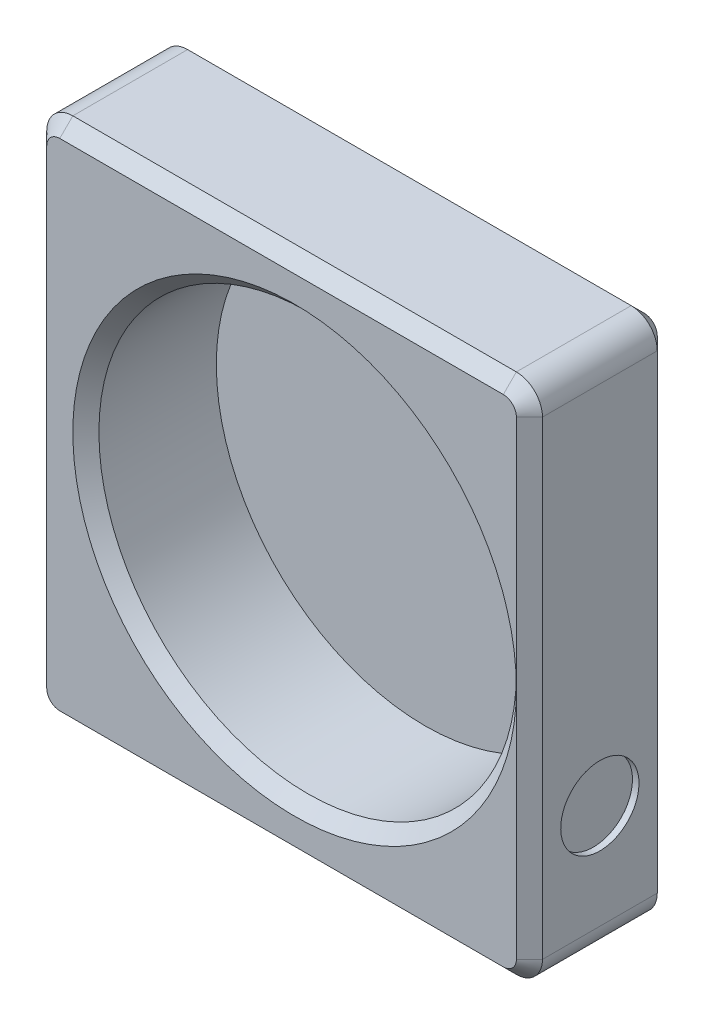
ISO-10303-21;
HEADER;
FILE_DESCRIPTION(('STEP AP214'),'2;1');
FILE_NAME('part.step','',(''),(''),'','','');
FILE_SCHEMA(('AUTOMOTIVE_DESIGN { 1 0 10303 214 1 1 1 1 }'));
ENDSEC;
DATA;
#1=APPLICATION_CONTEXT('core data for automotive mechanical design processes');
#2=APPLICATION_PROTOCOL_DEFINITION('international standard','automotive_design',2000,#1);
#3=PRODUCT_CONTEXT('',#1,'mechanical');
#4=PRODUCT('Part','Part','',(#3));
#5=PRODUCT_RELATED_PRODUCT_CATEGORY('part','',(#4));
#6=PRODUCT_DEFINITION_FORMATION('','',#4);
#7=PRODUCT_DEFINITION_CONTEXT('part definition',#1,'design');
#8=PRODUCT_DEFINITION('design','',#6,#7);
#9=PRODUCT_DEFINITION_SHAPE('','',#8);
#10=(LENGTH_UNIT() NAMED_UNIT(*) SI_UNIT(.MILLI.,.METRE.));
#11=(NAMED_UNIT(*) PLANE_ANGLE_UNIT() SI_UNIT($,.RADIAN.));
#12=(NAMED_UNIT(*) SI_UNIT($,.STERADIAN.) SOLID_ANGLE_UNIT());
#13=UNCERTAINTY_MEASURE_WITH_UNIT(LENGTH_MEASURE(1.E-05),#10,'distance_accuracy_value','');
#14=(GEOMETRIC_REPRESENTATION_CONTEXT(3) GLOBAL_UNCERTAINTY_ASSIGNED_CONTEXT((#13)) GLOBAL_UNIT_ASSIGNED_CONTEXT((#10,
#11,#12)) REPRESENTATION_CONTEXT('',''));
#15=CARTESIAN_POINT('',(0.,0.,0.));
#16=DIRECTION('',(0.,0.,1.));
#17=DIRECTION('',(1.,0.,0.));
#18=AXIS2_PLACEMENT_3D('',#15,#16,#17);
#19=CARTESIAN_POINT('',(-10.,-10.,5.4));
#20=DIRECTION('',(1.,0.,0.));
#21=DIRECTION('',(0.,0.,-1.));
#22=AXIS2_PLACEMENT_3D('',#19,#20,#21);
#23=PLANE('',#22);
#24=DIRECTION('',(0.,0.,1.));
#25=VECTOR('',#24,1.);
#26=CARTESIAN_POINT('',(-10.,4.5,0.));
#27=LINE('',#26,#25);
#28=CARTESIAN_POINT('',(-10.,4.5,0.500000000000004));
#29=VERTEX_POINT('',#28);
#30=CARTESIAN_POINT('',(-10.,4.5,4.9));
#31=VERTEX_POINT('',#30);
#32=EDGE_CURVE('E219',#29,#31,#27,.T.);
#33=ORIENTED_EDGE('',*,*,#32,.F.);
#34=DIRECTION('',(0.,-1.,0.));
#35=VECTOR('',#34,1.);
#36=CARTESIAN_POINT('',(-10.,-9.,0.500000000000004));
#37=LINE('',#36,#35);
#38=CARTESIAN_POINT('',(-10.,-9.,0.500000000000004));
#39=VERTEX_POINT('',#38);
#40=EDGE_CURVE('E193',#29,#39,#37,.T.);
#41=ORIENTED_EDGE('',*,*,#40,.T.);
#42=DIRECTION('',(0.,0.,-1.));
#43=VECTOR('',#42,1.);
#44=CARTESIAN_POINT('',(-10.,-9.,5.4));
#45=LINE('',#44,#43);
#46=CARTESIAN_POINT('',(-10.,-9.,4.9));
#47=VERTEX_POINT('',#46);
#48=EDGE_CURVE('E216',#39,#47,#45,.F.);
#49=ORIENTED_EDGE('',*,*,#48,.T.);
#50=DIRECTION('',(0.,1.,0.));
#51=VECTOR('',#50,1.);
#52=CARTESIAN_POINT('',(-10.,-10.,4.9));
#53=LINE('',#52,#51);
#54=EDGE_CURVE('E220',#47,#31,#53,.T.);
#55=ORIENTED_EDGE('',*,*,#54,.T.);
#56=EDGE_LOOP('',(#33,#41,#49,#55));
#57=FACE_BOUND('',#56,.T.);
#58=ADVANCED_FACE('F45',(#57),#23,.F.);
#59=CARTESIAN_POINT('',(-10.,10.,5.4));
#60=DIRECTION('',(0.,-1.,0.));
#61=DIRECTION('',(0.,0.,-1.));
#62=AXIS2_PLACEMENT_3D('',#59,#60,#61);
#63=PLANE('',#62);
#64=DIRECTION('',(0.,0.,1.));
#65=VECTOR('',#64,1.);
#66=CARTESIAN_POINT('',(8.,10.,5.4));
#67=LINE('',#66,#65);
#68=CARTESIAN_POINT('',(8.,10.,4.9));
#69=VERTEX_POINT('',#68);
#70=CARTESIAN_POINT('',(8.,10.,0.500000000000004));
#71=VERTEX_POINT('',#70);
#72=EDGE_CURVE('E225',#69,#71,#67,.F.);
#73=ORIENTED_EDGE('',*,*,#72,.T.);
#74=DIRECTION('',(-1.,0.,0.));
#75=VECTOR('',#74,1.);
#76=CARTESIAN_POINT('',(-9.,10.,0.500000000000004));
#77=LINE('',#76,#75);
#78=CARTESIAN_POINT('',(-9.,10.,0.500000000000004));
#79=VERTEX_POINT('',#78);
#80=EDGE_CURVE('E279',#71,#79,#77,.T.);
#81=ORIENTED_EDGE('',*,*,#80,.T.);
#82=DIRECTION('',(0.,0.,-1.));
#83=VECTOR('',#82,1.);
#84=CARTESIAN_POINT('',(-9.,10.,5.4));
#85=LINE('',#84,#83);
#86=CARTESIAN_POINT('',(-9.,10.,4.9));
#87=VERTEX_POINT('',#86);
#88=EDGE_CURVE('E230',#79,#87,#85,.F.);
#89=ORIENTED_EDGE('',*,*,#88,.T.);
#90=DIRECTION('',(1.,0.,0.));
#91=VECTOR('',#90,1.);
#92=CARTESIAN_POINT('',(-10.,10.,4.9));
#93=LINE('',#92,#91);
#94=EDGE_CURVE('E277',#87,#69,#93,.T.);
#95=ORIENTED_EDGE('',*,*,#94,.T.);
#96=EDGE_LOOP('',(#73,#81,#89,#95));
#97=FACE_BOUND('',#96,.T.);
#98=ADVANCED_FACE('F407',(#97),#63,.F.);
#99=DIRECTION('',(0.,0.,-1.));
#100=VECTOR('',#99,1.);
#101=CARTESIAN_POINT('',(-10.,9.,5.4));
#102=LINE('',#101,#100);
#103=CARTESIAN_POINT('',(-10.,9.,4.9));
#104=VERTEX_POINT('',#103);
#105=CARTESIAN_POINT('',(-10.,9.,0.500000000000004));
#106=VERTEX_POINT('',#105);
#107=EDGE_CURVE('E224',#104,#106,#102,.T.);
#108=ORIENTED_EDGE('',*,*,#107,.T.);
#109=DIRECTION('',(0.,-1.,0.));
#110=VECTOR('',#109,1.);
#111=CARTESIAN_POINT('',(-10.,5.5,0.500000000000004));
#112=LINE('',#111,#110);
#113=CARTESIAN_POINT('',(-10.,5.5,0.500000000000004));
#114=VERTEX_POINT('',#113);
#115=EDGE_CURVE('E288',#106,#114,#112,.T.);
#116=ORIENTED_EDGE('',*,*,#115,.T.);
#117=DIRECTION('',(0.,0.,-1.));
#118=VECTOR('',#117,1.);
#119=CARTESIAN_POINT('',(-10.,5.5,0.));
#120=LINE('',#119,#118);
#121=CARTESIAN_POINT('',(-10.,5.5,4.9));
#122=VERTEX_POINT('',#121);
#123=EDGE_CURVE('E506',#122,#114,#120,.T.);
#124=ORIENTED_EDGE('',*,*,#123,.F.);
#125=DIRECTION('',(0.,1.,0.));
#126=VECTOR('',#125,1.);
#127=CARTESIAN_POINT('',(-10.,-10.,4.9));
#128=LINE('',#127,#126);
#129=EDGE_CURVE('E286',#122,#104,#128,.T.);
#130=ORIENTED_EDGE('',*,*,#129,.T.);
#131=EDGE_LOOP('',(#108,#116,#124,#130));
#132=FACE_BOUND('',#131,.T.);
#133=ADVANCED_FACE('F476',(#132),#23,.F.);
#134=CARTESIAN_POINT('',(-10.,-10.,5.4));
#135=DIRECTION('',(0.,1.,0.));
#136=DIRECTION('',(0.,0.,1.));
#137=AXIS2_PLACEMENT_3D('',#134,#135,#136);
#138=PLANE('',#137);
#139=DIRECTION('',(0.,0.,-1.));
#140=VECTOR('',#139,1.);
#141=CARTESIAN_POINT('',(-9.,-10.,5.4));
#142=LINE('',#141,#140);
#143=CARTESIAN_POINT('',(-9.,-10.,4.9));
#144=VERTEX_POINT('',#143);
#145=CARTESIAN_POINT('',(-9.,-10.,0.500000000000004));
#146=VERTEX_POINT('',#145);
#147=EDGE_CURVE('E385',#144,#146,#142,.T.);
#148=ORIENTED_EDGE('',*,*,#147,.T.);
#149=DIRECTION('',(1.,0.,0.));
#150=VECTOR('',#149,1.);
#151=CARTESIAN_POINT('',(8.00000000000001,-10.,0.500000000000004));
#152=LINE('',#151,#150);
#153=CARTESIAN_POINT('',(8.00000000000001,-10.,0.500000000000004));
#154=VERTEX_POINT('',#153);
#155=EDGE_CURVE('E263',#146,#154,#152,.T.);
#156=ORIENTED_EDGE('',*,*,#155,.T.);
#157=DIRECTION('',(0.,0.,1.));
#158=VECTOR('',#157,1.);
#159=CARTESIAN_POINT('',(8.00000000000001,-10.,5.4));
#160=LINE('',#159,#158);
#161=CARTESIAN_POINT('',(8.00000000000001,-10.,4.9));
#162=VERTEX_POINT('',#161);
#163=EDGE_CURVE('E390',#154,#162,#160,.T.);
#164=ORIENTED_EDGE('',*,*,#163,.T.);
#165=DIRECTION('',(-1.,0.,0.));
#166=VECTOR('',#165,1.);
#167=CARTESIAN_POINT('',(-10.,-10.,4.9));
#168=LINE('',#167,#166);
#169=EDGE_CURVE('E209',#162,#144,#168,.T.);
#170=ORIENTED_EDGE('',*,*,#169,.T.);
#171=EDGE_LOOP('',(#148,#156,#164,#170));
#172=FACE_BOUND('',#171,.T.);
#173=ADVANCED_FACE('F439',(#172),#138,.F.);
#174=CARTESIAN_POINT('',(0.,0.,5.4));
#175=DIRECTION('',(0.,0.,-1.));
#176=DIRECTION('',(-1.,0.,0.));
#177=AXIS2_PLACEMENT_3D('',#174,#175,#176);
#178=PLANE('',#177);
#179=CARTESIAN_POINT('',(8.00000000000001,-9.,5.4));
#180=DIRECTION('',(0.,0.,-1.));
#181=DIRECTION('',(-1.,0.,0.));
#182=AXIS2_PLACEMENT_3D('',#179,#180,#181);
#183=CIRCLE('',#182,0.5);
#184=CARTESIAN_POINT('',(8.00000000000001,-9.5,5.4));
#185=VERTEX_POINT('',#184);
#186=CARTESIAN_POINT('',(8.50000000000001,-9.,5.4));
#187=VERTEX_POINT('',#186);
#188=EDGE_CURVE('E63',#185,#187,#183,.F.);
#189=ORIENTED_EDGE('',*,*,#188,.T.);
#190=DIRECTION('',(0.,1.,0.));
#191=VECTOR('',#190,1.);
#192=CARTESIAN_POINT('',(8.5,0.,5.4));
#193=LINE('',#192,#191);
#194=CARTESIAN_POINT('',(8.5,0.,5.4));
#195=VERTEX_POINT('',#194);
#196=EDGE_CURVE('E55',#187,#195,#193,.T.);
#197=ORIENTED_EDGE('',*,*,#196,.T.);
#198=CARTESIAN_POINT('',(0.,0.,5.4));
#199=DIRECTION('',(0.,0.,-1.));
#200=DIRECTION('',(-1.,0.,0.));
#201=AXIS2_PLACEMENT_3D('',#198,#199,#200);
#202=CIRCLE('',#201,8.5);
#203=EDGE_CURVE('E295',#195,#195,#202,.T.);
#204=ORIENTED_EDGE('',*,*,#203,.T.);
#205=DIRECTION('',(0.,1.,0.));
#206=VECTOR('',#205,1.);
#207=CARTESIAN_POINT('',(8.5,0.,5.4));
#208=LINE('',#207,#206);
#209=CARTESIAN_POINT('',(8.5,9.,5.4));
#210=VERTEX_POINT('',#209);
#211=EDGE_CURVE('E298',#195,#210,#208,.T.);
#212=ORIENTED_EDGE('',*,*,#211,.T.);
#213=CARTESIAN_POINT('',(8.,9.,5.4));
#214=DIRECTION('',(0.,0.,-1.));
#215=DIRECTION('',(-1.,0.,0.));
#216=AXIS2_PLACEMENT_3D('',#213,#214,#215);
#217=CIRCLE('',#216,0.499999999999999);
#218=CARTESIAN_POINT('',(8.,9.5,5.4));
#219=VERTEX_POINT('',#218);
#220=EDGE_CURVE('E300',#210,#219,#217,.F.);
#221=ORIENTED_EDGE('',*,*,#220,.T.);
#222=DIRECTION('',(-1.,0.,0.));
#223=VECTOR('',#222,1.);
#224=CARTESIAN_POINT('',(0.,9.5,5.4));
#225=LINE('',#224,#223);
#226=CARTESIAN_POINT('',(-9.,9.5,5.4));
#227=VERTEX_POINT('',#226);
#228=EDGE_CURVE('E302',#219,#227,#225,.T.);
#229=ORIENTED_EDGE('',*,*,#228,.T.);
#230=CARTESIAN_POINT('',(-9.,9.,5.4));
#231=DIRECTION('',(0.,0.,-1.));
#232=DIRECTION('',(-1.,0.,0.));
#233=AXIS2_PLACEMENT_3D('',#230,#231,#232);
#234=CIRCLE('',#233,0.499999999999999);
#235=CARTESIAN_POINT('',(-9.5,9.,5.4));
#236=VERTEX_POINT('',#235);
#237=EDGE_CURVE('E304',#227,#236,#234,.F.);
#238=ORIENTED_EDGE('',*,*,#237,.T.);
#239=DIRECTION('',(0.,-1.,0.));
#240=VECTOR('',#239,1.);
#241=CARTESIAN_POINT('',(-9.5,0.,5.4));
#242=LINE('',#241,#240);
#243=CARTESIAN_POINT('',(-9.5,-9.,5.4));
#244=VERTEX_POINT('',#243);
#245=EDGE_CURVE('E306',#236,#244,#242,.T.);
#246=ORIENTED_EDGE('',*,*,#245,.T.);
#247=CARTESIAN_POINT('',(-9.,-9.,5.4));
#248=DIRECTION('',(0.,0.,-1.));
#249=DIRECTION('',(-1.,0.,0.));
#250=AXIS2_PLACEMENT_3D('',#247,#248,#249);
#251=CIRCLE('',#250,0.499999999999999);
#252=CARTESIAN_POINT('',(-9.,-9.5,5.4));
#253=VERTEX_POINT('',#252);
#254=EDGE_CURVE('E308',#244,#253,#251,.F.);
#255=ORIENTED_EDGE('',*,*,#254,.T.);
#256=DIRECTION('',(1.,0.,0.));
#257=VECTOR('',#256,1.);
#258=CARTESIAN_POINT('',(0.,-9.5,5.4));
#259=LINE('',#258,#257);
#260=EDGE_CURVE('E68',#253,#185,#259,.T.);
#261=ORIENTED_EDGE('',*,*,#260,.T.);
#262=EDGE_LOOP('',(#189,#197,#204,#212,#221,#229,#238,#246,#255,#261));
#263=FACE_BOUND('',#262,.T.);
#264=ADVANCED_FACE('F366',(#263),#178,.F.);
#265=CARTESIAN_POINT('',(0.,0.,0.));
#266=DIRECTION('',(0.,0.,-1.));
#267=DIRECTION('',(-1.,0.,0.));
#268=AXIS2_PLACEMENT_3D('',#265,#266,#267);
#269=PLANE('',#268);
#270=CARTESIAN_POINT('',(-9.,-9.,0.));
#271=DIRECTION('',(0.,0.,-1.));
#272=DIRECTION('',(-1.,0.,0.));
#273=AXIS2_PLACEMENT_3D('',#270,#271,#272);
#274=CIRCLE('',#273,0.499999999999995);
#275=CARTESIAN_POINT('',(-9.,-9.5,0.));
#276=VERTEX_POINT('',#275);
#277=CARTESIAN_POINT('',(-9.5,-9.,0.));
#278=VERTEX_POINT('',#277);
#279=EDGE_CURVE('E250',#276,#278,#274,.T.);
#280=ORIENTED_EDGE('',*,*,#279,.T.);
#281=DIRECTION('',(0.,1.,0.));
#282=VECTOR('',#281,1.);
#283=CARTESIAN_POINT('',(-9.5,9.,0.));
#284=LINE('',#283,#282);
#285=CARTESIAN_POINT('',(-9.5,9.,0.));
#286=VERTEX_POINT('',#285);
#287=EDGE_CURVE('E194',#278,#286,#284,.T.);
#288=ORIENTED_EDGE('',*,*,#287,.T.);
#289=CARTESIAN_POINT('',(-9.,9.,0.));
#290=DIRECTION('',(0.,0.,-1.));
#291=DIRECTION('',(-1.,0.,0.));
#292=AXIS2_PLACEMENT_3D('',#289,#290,#291);
#293=CIRCLE('',#292,0.499999999999995);
#294=CARTESIAN_POINT('',(-9.,9.49999999999999,0.));
#295=VERTEX_POINT('',#294);
#296=EDGE_CURVE('E237',#286,#295,#293,.T.);
#297=ORIENTED_EDGE('',*,*,#296,.T.);
#298=DIRECTION('',(1.,0.,0.));
#299=VECTOR('',#298,1.);
#300=CARTESIAN_POINT('',(8.,9.5,0.));
#301=LINE('',#300,#299);
#302=CARTESIAN_POINT('',(8.,9.5,0.));
#303=VERTEX_POINT('',#302);
#304=EDGE_CURVE('E239',#295,#303,#301,.T.);
#305=ORIENTED_EDGE('',*,*,#304,.T.);
#306=CARTESIAN_POINT('',(8.,9.,0.));
#307=DIRECTION('',(0.,0.,-1.));
#308=DIRECTION('',(-1.,0.,0.));
#309=AXIS2_PLACEMENT_3D('',#306,#307,#308);
#310=CIRCLE('',#309,0.499999999999995);
#311=CARTESIAN_POINT('',(8.49999999999999,9.,0.));
#312=VERTEX_POINT('',#311);
#313=EDGE_CURVE('E242',#303,#312,#310,.T.);
#314=ORIENTED_EDGE('',*,*,#313,.T.);
#315=DIRECTION('',(0.,-1.,0.));
#316=VECTOR('',#315,1.);
#317=CARTESIAN_POINT('',(8.5,-9.,0.));
#318=LINE('',#317,#316);
#319=CARTESIAN_POINT('',(8.5,-9.,0.));
#320=VERTEX_POINT('',#319);
#321=EDGE_CURVE('E244',#312,#320,#318,.T.);
#322=ORIENTED_EDGE('',*,*,#321,.T.);
#323=CARTESIAN_POINT('',(8.00000000000001,-9.,0.));
#324=DIRECTION('',(0.,0.,-1.));
#325=DIRECTION('',(-1.,0.,0.));
#326=AXIS2_PLACEMENT_3D('',#323,#324,#325);
#327=CIRCLE('',#326,0.499999999999997);
#328=CARTESIAN_POINT('',(8.00000000000001,-9.5,0.));
#329=VERTEX_POINT('',#328);
#330=EDGE_CURVE('E246',#320,#329,#327,.T.);
#331=ORIENTED_EDGE('',*,*,#330,.T.);
#332=DIRECTION('',(-1.,0.,0.));
#333=VECTOR('',#332,1.);
#334=CARTESIAN_POINT('',(-9.,-9.5,0.));
#335=LINE('',#334,#333);
#336=EDGE_CURVE('E248',#329,#276,#335,.T.);
#337=ORIENTED_EDGE('',*,*,#336,.T.);
#338=EDGE_LOOP('',(#280,#288,#297,#305,#314,#322,#331,#337));
#339=FACE_BOUND('',#338,.T.);
#340=ADVANCED_FACE('F378',(#339),#269,.T.);
#341=CARTESIAN_POINT('',(0.,0.,0.4));
#342=DIRECTION('',(0.,0.,1.));
#343=DIRECTION('',(1.,0.,0.));
#344=AXIS2_PLACEMENT_3D('',#341,#342,#343);
#345=CYLINDRICAL_SURFACE('',#344,8.);
#346=CARTESIAN_POINT('',(0.,0.,4.9));
#347=DIRECTION('',(0.,0.,-1.));
#348=DIRECTION('',(-1.,0.,0.));
#349=AXIS2_PLACEMENT_3D('',#346,#347,#348);
#350=CIRCLE('',#349,8.);
#351=CARTESIAN_POINT('',(-8.,0.,4.9));
#352=VERTEX_POINT('',#351);
#353=EDGE_CURVE('E11',#352,#352,#350,.F.);
#354=ORIENTED_EDGE('',*,*,#353,.T.);
#355=EDGE_LOOP('',(#354));
#356=FACE_BOUND('',#355,.T.);
#357=CARTESIAN_POINT('',(0.,0.,0.4));
#358=DIRECTION('',(0.,0.,1.));
#359=DIRECTION('',(1.,0.,0.));
#360=AXIS2_PLACEMENT_3D('',#357,#358,#359);
#361=CIRCLE('',#360,8.);
#362=CARTESIAN_POINT('',(8.,0.,0.4));
#363=VERTEX_POINT('',#362);
#364=EDGE_CURVE('E382',#363,#363,#361,.T.);
#365=ORIENTED_EDGE('',*,*,#364,.F.);
#366=EDGE_LOOP('',(#365));
#367=FACE_BOUND('',#366,.T.);
#368=ADVANCED_FACE('F374',(#356,#367),#345,.F.);
#369=CARTESIAN_POINT('',(0.,0.,0.4));
#370=DIRECTION('',(0.,0.,1.));
#371=DIRECTION('',(1.,0.,0.));
#372=AXIS2_PLACEMENT_3D('',#369,#370,#371);
#373=PLANE('',#372);
#374=ORIENTED_EDGE('',*,*,#364,.T.);
#375=EDGE_LOOP('',(#374));
#376=FACE_BOUND('',#375,.T.);
#377=ADVANCED_FACE('F377',(#376),#373,.T.);
#378=CARTESIAN_POINT('',(9.,10.,-4.6));
#379=DIRECTION('',(-1.,0.,0.));
#380=DIRECTION('',(0.,-1.,0.));
#381=AXIS2_PLACEMENT_3D('',#378,#379,#380);
#382=PLANE('',#381);
#383=CARTESIAN_POINT('',(9.00000000000001,-5.,2.7));
#384=DIRECTION('',(1.,0.,0.));
#385=DIRECTION('',(0.,1.,0.));
#386=AXIS2_PLACEMENT_3D('',#383,#384,#385);
#387=CIRCLE('',#386,1.5);
#388=CARTESIAN_POINT('',(9.00000000000001,-3.5,2.7));
#389=VERTEX_POINT('',#388);
#390=EDGE_CURVE('E393',#389,#389,#387,.T.);
#391=ORIENTED_EDGE('',*,*,#390,.F.);
#392=EDGE_LOOP('',(#391));
#393=FACE_BOUND('',#392,.T.);
#394=DIRECTION('',(0.,0.,1.));
#395=VECTOR('',#394,1.);
#396=CARTESIAN_POINT('',(9.00000000000001,-9.,-4.6));
#397=LINE('',#396,#395);
#398=CARTESIAN_POINT('',(9.00000000000001,-9.,4.9));
#399=VERTEX_POINT('',#398);
#400=CARTESIAN_POINT('',(9.00000000000001,-9.,0.500000000000004));
#401=VERTEX_POINT('',#400);
#402=EDGE_CURVE('E402',#399,#401,#397,.F.);
#403=ORIENTED_EDGE('',*,*,#402,.T.);
#404=DIRECTION('',(0.,1.,0.));
#405=VECTOR('',#404,1.);
#406=CARTESIAN_POINT('',(9.,9.,0.500000000000004));
#407=LINE('',#406,#405);
#408=CARTESIAN_POINT('',(9.,9.,0.500000000000004));
#409=VERTEX_POINT('',#408);
#410=EDGE_CURVE('E271',#401,#409,#407,.T.);
#411=ORIENTED_EDGE('',*,*,#410,.T.);
#412=DIRECTION('',(0.,0.,1.));
#413=VECTOR('',#412,1.);
#414=CARTESIAN_POINT('',(9.,9.,-4.6));
#415=LINE('',#414,#413);
#416=CARTESIAN_POINT('',(9.,9.,4.9));
#417=VERTEX_POINT('',#416);
#418=EDGE_CURVE('E399',#409,#417,#415,.T.);
#419=ORIENTED_EDGE('',*,*,#418,.T.);
#420=DIRECTION('',(0.,-1.,0.));
#421=VECTOR('',#420,1.);
#422=CARTESIAN_POINT('',(9.,10.,4.9));
#423=LINE('',#422,#421);
#424=EDGE_CURVE('E269',#417,#399,#423,.T.);
#425=ORIENTED_EDGE('',*,*,#424,.T.);
#426=EDGE_LOOP('',(#403,#411,#419,#425));
#427=FACE_BOUND('',#426,.T.);
#428=ADVANCED_FACE('F451',(#393,#427),#382,.F.);
#429=CARTESIAN_POINT('',(8.75000000000001,-5.,2.7));
#430=DIRECTION('',(1.,0.,0.));
#431=DIRECTION('',(0.,1.,0.));
#432=AXIS2_PLACEMENT_3D('',#429,#430,#431);
#433=CYLINDRICAL_SURFACE('',#432,1.5);
#434=CARTESIAN_POINT('',(8.75000000000001,-5.,2.7));
#435=DIRECTION('',(1.,0.,0.));
#436=DIRECTION('',(0.,1.,0.));
#437=AXIS2_PLACEMENT_3D('',#434,#435,#436);
#438=CIRCLE('',#437,1.5);
#439=CARTESIAN_POINT('',(8.75000000000001,-3.5,2.7));
#440=VERTEX_POINT('',#439);
#441=EDGE_CURVE('E386',#440,#440,#438,.T.);
#442=ORIENTED_EDGE('',*,*,#441,.F.);
#443=EDGE_LOOP('',(#442));
#444=FACE_BOUND('',#443,.T.);
#445=ORIENTED_EDGE('',*,*,#390,.T.);
#446=EDGE_LOOP('',(#445));
#447=FACE_BOUND('',#446,.T.);
#448=ADVANCED_FACE('F527',(#444,#447),#433,.F.);
#449=CARTESIAN_POINT('',(8.75000000000001,-5.,2.7));
#450=DIRECTION('',(1.,0.,0.));
#451=DIRECTION('',(0.,1.,0.));
#452=AXIS2_PLACEMENT_3D('',#449,#450,#451);
#453=PLANE('',#452);
#454=ORIENTED_EDGE('',*,*,#441,.T.);
#455=EDGE_LOOP('',(#454));
#456=FACE_BOUND('',#455,.T.);
#457=ADVANCED_FACE('F519',(#456),#453,.T.);
#458=CARTESIAN_POINT('',(-9.75,4.5,0.));
#459=DIRECTION('',(0.,-1.,0.));
#460=DIRECTION('',(0.,0.,-1.));
#461=AXIS2_PLACEMENT_3D('',#458,#459,#460);
#462=PLANE('',#461);
#463=DIRECTION('',(0.,0.,1.));
#464=VECTOR('',#463,1.);
#465=CARTESIAN_POINT('',(-9.75,4.5,0.));
#466=LINE('',#465,#464);
#467=CARTESIAN_POINT('',(-9.75,4.5,0.250000000000004));
#468=VERTEX_POINT('',#467);
#469=CARTESIAN_POINT('',(-9.75,4.5,5.15));
#470=VERTEX_POINT('',#469);
#471=EDGE_CURVE('E510',#468,#470,#466,.T.);
#472=ORIENTED_EDGE('',*,*,#471,.F.);
#473=DIRECTION('',(-0.707106781186548,0.,0.707106781186548));
#474=VECTOR('',#473,1.);
#475=CARTESIAN_POINT('',(-10.,4.5,0.500000000000004));
#476=LINE('',#475,#474);
#477=EDGE_CURVE('E259',#468,#29,#476,.T.);
#478=ORIENTED_EDGE('',*,*,#477,.T.);
#479=ORIENTED_EDGE('',*,*,#32,.T.);
#480=DIRECTION('',(-0.707106781186548,0.,-0.707106781186548));
#481=VECTOR('',#480,1.);
#482=CARTESIAN_POINT('',(-9.5,4.5,5.4));
#483=LINE('',#482,#481);
#484=EDGE_CURVE('E256',#31,#470,#483,.F.);
#485=ORIENTED_EDGE('',*,*,#484,.T.);
#486=EDGE_LOOP('',(#472,#478,#479,#485));
#487=FACE_BOUND('',#486,.T.);
#488=ADVANCED_FACE('F517',(#487),#462,.F.);
#489=CARTESIAN_POINT('',(-9.75,5.5,0.));
#490=DIRECTION('',(0.,1.,0.));
#491=DIRECTION('',(0.,0.,1.));
#492=AXIS2_PLACEMENT_3D('',#489,#490,#491);
#493=PLANE('',#492);
#494=ORIENTED_EDGE('',*,*,#123,.T.);
#495=DIRECTION('',(0.707106781186548,0.,-0.707106781186548));
#496=VECTOR('',#495,1.);
#497=CARTESIAN_POINT('',(-10.,5.5,0.500000000000004));
#498=LINE('',#497,#496);
#499=CARTESIAN_POINT('',(-9.75,5.5,0.250000000000004));
#500=VERTEX_POINT('',#499);
#501=EDGE_CURVE('E293',#114,#500,#498,.T.);
#502=ORIENTED_EDGE('',*,*,#501,.T.);
#503=DIRECTION('',(0.,0.,-1.));
#504=VECTOR('',#503,1.);
#505=CARTESIAN_POINT('',(-9.75,5.5,0.));
#506=LINE('',#505,#504);
#507=CARTESIAN_POINT('',(-9.75,5.5,5.15));
#508=VERTEX_POINT('',#507);
#509=EDGE_CURVE('E505',#508,#500,#506,.T.);
#510=ORIENTED_EDGE('',*,*,#509,.F.);
#511=DIRECTION('',(0.707106781186548,0.,0.707106781186548));
#512=VECTOR('',#511,1.);
#513=CARTESIAN_POINT('',(-9.5,5.5,5.4));
#514=LINE('',#513,#512);
#515=EDGE_CURVE('E291',#508,#122,#514,.F.);
#516=ORIENTED_EDGE('',*,*,#515,.T.);
#517=EDGE_LOOP('',(#494,#502,#510,#516));
#518=FACE_BOUND('',#517,.T.);
#519=ADVANCED_FACE('F504',(#518),#493,.F.);
#520=CARTESIAN_POINT('',(-9.75,0.,0.));
#521=DIRECTION('',(1.,0.,0.));
#522=DIRECTION('',(0.,0.,-1.));
#523=AXIS2_PLACEMENT_3D('',#520,#521,#522);
#524=PLANE('',#523);
#525=DIRECTION('',(0.,-1.,0.));
#526=VECTOR('',#525,1.);
#527=CARTESIAN_POINT('',(-9.75,-10.,0.250000000000004));
#528=LINE('',#527,#526);
#529=EDGE_CURVE('E254',#500,#468,#528,.T.);
#530=ORIENTED_EDGE('',*,*,#529,.T.);
#531=ORIENTED_EDGE('',*,*,#471,.T.);
#532=DIRECTION('',(0.,-1.,0.));
#533=VECTOR('',#532,1.);
#534=CARTESIAN_POINT('',(-9.75,0.,5.15));
#535=LINE('',#534,#533);
#536=EDGE_CURVE('E252',#470,#508,#535,.F.);
#537=ORIENTED_EDGE('',*,*,#536,.T.);
#538=ORIENTED_EDGE('',*,*,#509,.T.);
#539=EDGE_LOOP('',(#530,#531,#537,#538));
#540=FACE_BOUND('',#539,.T.);
#541=ADVANCED_FACE('F472',(#540),#524,.F.);
#542=CARTESIAN_POINT('',(8.00000000000001,-9.,5.4));
#543=DIRECTION('',(0.,0.,1.));
#544=DIRECTION('',(1.,0.,0.));
#545=AXIS2_PLACEMENT_3D('',#542,#543,#544);
#546=CYLINDRICAL_SURFACE('',#545,1.);
#547=ORIENTED_EDGE('',*,*,#163,.F.);
#548=CARTESIAN_POINT('',(8.00000000000001,-9.,0.500000000000004));
#549=DIRECTION('',(0.,0.,-1.));
#550=DIRECTION('',(-1.,0.,0.));
#551=AXIS2_PLACEMENT_3D('',#548,#549,#550);
#552=CIRCLE('',#551,1.);
#553=EDGE_CURVE('E267',#154,#401,#552,.F.);
#554=ORIENTED_EDGE('',*,*,#553,.T.);
#555=ORIENTED_EDGE('',*,*,#402,.F.);
#556=CARTESIAN_POINT('',(8.00000000000001,-9.,4.9));
#557=DIRECTION('',(0.,0.,-1.));
#558=DIRECTION('',(-1.,0.,0.));
#559=AXIS2_PLACEMENT_3D('',#556,#557,#558);
#560=CIRCLE('',#559,1.);
#561=EDGE_CURVE('E265',#399,#162,#560,.T.);
#562=ORIENTED_EDGE('',*,*,#561,.T.);
#563=EDGE_LOOP('',(#547,#554,#555,#562));
#564=FACE_BOUND('',#563,.T.);
#565=ADVANCED_FACE('F436',(#564),#546,.T.);
#566=CARTESIAN_POINT('',(8.,9.,-4.6));
#567=DIRECTION('',(0.,0.,1.));
#568=DIRECTION('',(1.,0.,0.));
#569=AXIS2_PLACEMENT_3D('',#566,#567,#568);
#570=CYLINDRICAL_SURFACE('',#569,1.);
#571=ORIENTED_EDGE('',*,*,#418,.F.);
#572=CARTESIAN_POINT('',(8.,9.,0.500000000000004));
#573=DIRECTION('',(0.,0.,-1.));
#574=DIRECTION('',(-1.,0.,0.));
#575=AXIS2_PLACEMENT_3D('',#572,#573,#574);
#576=CIRCLE('',#575,1.);
#577=EDGE_CURVE('E275',#409,#71,#576,.F.);
#578=ORIENTED_EDGE('',*,*,#577,.T.);
#579=ORIENTED_EDGE('',*,*,#72,.F.);
#580=CARTESIAN_POINT('',(8.,9.,4.9));
#581=DIRECTION('',(0.,0.,-1.));
#582=DIRECTION('',(-1.,0.,0.));
#583=AXIS2_PLACEMENT_3D('',#580,#581,#582);
#584=CIRCLE('',#583,1.);
#585=EDGE_CURVE('E273',#69,#417,#584,.T.);
#586=ORIENTED_EDGE('',*,*,#585,.T.);
#587=EDGE_LOOP('',(#571,#578,#579,#586));
#588=FACE_BOUND('',#587,.T.);
#589=ADVANCED_FACE('F463',(#588),#570,.T.);
#590=CARTESIAN_POINT('',(-9.,-9.,5.4));
#591=DIRECTION('',(0.,0.,-1.));
#592=DIRECTION('',(-1.,0.,0.));
#593=AXIS2_PLACEMENT_3D('',#590,#591,#592);
#594=CYLINDRICAL_SURFACE('',#593,1.);
#595=ORIENTED_EDGE('',*,*,#48,.F.);
#596=CARTESIAN_POINT('',(-9.,-9.,0.500000000000004));
#597=DIRECTION('',(0.,0.,-1.));
#598=DIRECTION('',(-1.,0.,0.));
#599=AXIS2_PLACEMENT_3D('',#596,#597,#598);
#600=CIRCLE('',#599,1.);
#601=EDGE_CURVE('E201',#39,#146,#600,.F.);
#602=ORIENTED_EDGE('',*,*,#601,.T.);
#603=ORIENTED_EDGE('',*,*,#147,.F.);
#604=CARTESIAN_POINT('',(-9.,-9.,4.9));
#605=DIRECTION('',(0.,0.,-1.));
#606=DIRECTION('',(-1.,0.,0.));
#607=AXIS2_PLACEMENT_3D('',#604,#605,#606);
#608=CIRCLE('',#607,1.);
#609=EDGE_CURVE('E210',#144,#47,#608,.T.);
#610=ORIENTED_EDGE('',*,*,#609,.T.);
#611=EDGE_LOOP('',(#595,#602,#603,#610));
#612=FACE_BOUND('',#611,.T.);
#613=ADVANCED_FACE('F222',(#612),#594,.T.);
#614=CARTESIAN_POINT('',(-9.,9.,5.4));
#615=DIRECTION('',(0.,0.,-1.));
#616=DIRECTION('',(-1.,0.,0.));
#617=AXIS2_PLACEMENT_3D('',#614,#615,#616);
#618=CYLINDRICAL_SURFACE('',#617,1.);
#619=ORIENTED_EDGE('',*,*,#88,.F.);
#620=CARTESIAN_POINT('',(-9.,9.,0.500000000000004));
#621=DIRECTION('',(0.,0.,-1.));
#622=DIRECTION('',(-1.,0.,0.));
#623=AXIS2_PLACEMENT_3D('',#620,#621,#622);
#624=CIRCLE('',#623,1.);
#625=EDGE_CURVE('E284',#79,#106,#624,.F.);
#626=ORIENTED_EDGE('',*,*,#625,.T.);
#627=ORIENTED_EDGE('',*,*,#107,.F.);
#628=CARTESIAN_POINT('',(-9.,9.,4.9));
#629=DIRECTION('',(0.,0.,-1.));
#630=DIRECTION('',(-1.,0.,0.));
#631=AXIS2_PLACEMENT_3D('',#628,#629,#630);
#632=CIRCLE('',#631,1.);
#633=EDGE_CURVE('E282',#104,#87,#632,.T.);
#634=ORIENTED_EDGE('',*,*,#633,.T.);
#635=EDGE_LOOP('',(#619,#626,#627,#634));
#636=FACE_BOUND('',#635,.T.);
#637=ADVANCED_FACE('F470',(#636),#618,.T.);
#638=CARTESIAN_POINT('',(8.,9.,0.));
#639=DIRECTION('',(0.,0.,1.));
#640=DIRECTION('',(1.,0.,0.));
#641=AXIS2_PLACEMENT_3D('',#638,#639,#640);
#642=CONICAL_SURFACE('',#641,0.499999999999995,0.785398163397449);
#643=DIRECTION('',(0.,-0.707106781186547,-0.707106781186547));
#644=VECTOR('',#643,1.);
#645=CARTESIAN_POINT('',(8.,10.,0.500000000000004));
#646=LINE('',#645,#644);
#647=EDGE_CURVE('E326',#71,#303,#646,.T.);
#648=ORIENTED_EDGE('',*,*,#647,.F.);
#649=ORIENTED_EDGE('',*,*,#577,.F.);
#650=DIRECTION('',(0.707106781186549,0.,0.707106781186546));
#651=VECTOR('',#650,1.);
#652=CARTESIAN_POINT('',(8.49999999999999,9.,0.));
#653=LINE('',#652,#651);
#654=EDGE_CURVE('E329',#312,#409,#653,.T.);
#655=ORIENTED_EDGE('',*,*,#654,.F.);
#656=ORIENTED_EDGE('',*,*,#313,.F.);
#657=EDGE_LOOP('',(#648,#649,#655,#656));
#658=FACE_BOUND('',#657,.T.);
#659=ADVANCED_FACE('F461',(#658),#642,.T.);
#660=CARTESIAN_POINT('',(9.,10.,0.500000000000004));
#661=DIRECTION('',(0.707106781186548,0.,-0.707106781186547));
#662=DIRECTION('',(0.,-1.,0.));
#663=AXIS2_PLACEMENT_3D('',#660,#661,#662);
#664=PLANE('',#663);
#665=ORIENTED_EDGE('',*,*,#654,.T.);
#666=ORIENTED_EDGE('',*,*,#410,.F.);
#667=DIRECTION('',(0.707106781186547,0.,0.707106781186547));
#668=VECTOR('',#667,1.);
#669=CARTESIAN_POINT('',(8.5,-9.,0.));
#670=LINE('',#669,#668);
#671=EDGE_CURVE('E323',#320,#401,#670,.T.);
#672=ORIENTED_EDGE('',*,*,#671,.F.);
#673=ORIENTED_EDGE('',*,*,#321,.F.);
#674=EDGE_LOOP('',(#665,#666,#672,#673));
#675=FACE_BOUND('',#674,.T.);
#676=ADVANCED_FACE('F454',(#675),#664,.T.);
#677=CARTESIAN_POINT('',(-10.,10.,0.500000000000004));
#678=DIRECTION('',(0.,0.707106781186547,-0.707106781186547));
#679=DIRECTION('',(1.,0.,0.));
#680=AXIS2_PLACEMENT_3D('',#677,#678,#679);
#681=PLANE('',#680);
#682=ORIENTED_EDGE('',*,*,#647,.T.);
#683=ORIENTED_EDGE('',*,*,#304,.F.);
#684=DIRECTION('',(0.,-0.707106781186547,-0.707106781186547));
#685=VECTOR('',#684,1.);
#686=CARTESIAN_POINT('',(-9.,10.,0.500000000000004));
#687=LINE('',#686,#685);
#688=EDGE_CURVE('E320',#79,#295,#687,.T.);
#689=ORIENTED_EDGE('',*,*,#688,.F.);
#690=ORIENTED_EDGE('',*,*,#80,.F.);
#691=EDGE_LOOP('',(#682,#683,#689,#690));
#692=FACE_BOUND('',#691,.T.);
#693=ADVANCED_FACE('F546',(#692),#681,.T.);
#694=CARTESIAN_POINT('',(8.00000000000001,-9.,0.));
#695=DIRECTION('',(0.,0.,1.));
#696=DIRECTION('',(1.,0.,0.));
#697=AXIS2_PLACEMENT_3D('',#694,#695,#696);
#698=CONICAL_SURFACE('',#697,0.499999999999997,0.785398163397447);
#699=ORIENTED_EDGE('',*,*,#671,.T.);
#700=ORIENTED_EDGE('',*,*,#553,.F.);
#701=DIRECTION('',(0.,-0.707106781186546,0.707106781186549));
#702=VECTOR('',#701,1.);
#703=CARTESIAN_POINT('',(8.00000000000001,-9.5,0.));
#704=LINE('',#703,#702);
#705=EDGE_CURVE('E317',#329,#154,#704,.T.);
#706=ORIENTED_EDGE('',*,*,#705,.F.);
#707=ORIENTED_EDGE('',*,*,#330,.F.);
#708=EDGE_LOOP('',(#699,#700,#706,#707));
#709=FACE_BOUND('',#708,.T.);
#710=ADVANCED_FACE('F447',(#709),#698,.T.);
#711=CARTESIAN_POINT('',(-9.,9.,0.));
#712=DIRECTION('',(0.,0.,1.));
#713=DIRECTION('',(1.,0.,0.));
#714=AXIS2_PLACEMENT_3D('',#711,#712,#713);
#715=CONICAL_SURFACE('',#714,0.499999999999995,0.785398163397449);
#716=ORIENTED_EDGE('',*,*,#688,.T.);
#717=ORIENTED_EDGE('',*,*,#296,.F.);
#718=DIRECTION('',(0.707106781186547,0.,-0.707106781186547));
#719=VECTOR('',#718,1.);
#720=CARTESIAN_POINT('',(-10.,9.,0.500000000000004));
#721=LINE('',#720,#719);
#722=EDGE_CURVE('E315',#106,#286,#721,.T.);
#723=ORIENTED_EDGE('',*,*,#722,.F.);
#724=ORIENTED_EDGE('',*,*,#625,.F.);
#725=EDGE_LOOP('',(#716,#717,#723,#724));
#726=FACE_BOUND('',#725,.T.);
#727=ADVANCED_FACE('F498',(#726),#715,.T.);
#728=CARTESIAN_POINT('',(-10.,-10.,0.500000000000004));
#729=DIRECTION('',(0.,-0.707106781186547,-0.707106781186547));
#730=DIRECTION('',(-1.,0.,0.));
#731=AXIS2_PLACEMENT_3D('',#728,#729,#730);
#732=PLANE('',#731);
#733=ORIENTED_EDGE('',*,*,#705,.T.);
#734=ORIENTED_EDGE('',*,*,#155,.F.);
#735=DIRECTION('',(0.,-0.707106781186547,0.707106781186547));
#736=VECTOR('',#735,1.);
#737=CARTESIAN_POINT('',(-9.,-9.5,0.));
#738=LINE('',#737,#736);
#739=EDGE_CURVE('E198',#276,#146,#738,.T.);
#740=ORIENTED_EDGE('',*,*,#739,.F.);
#741=ORIENTED_EDGE('',*,*,#336,.F.);
#742=EDGE_LOOP('',(#733,#734,#740,#741));
#743=FACE_BOUND('',#742,.T.);
#744=ADVANCED_FACE('F442',(#743),#732,.T.);
#745=CARTESIAN_POINT('',(-10.,-10.,0.500000000000004));
#746=DIRECTION('',(-0.707106781186547,0.,-0.707106781186547));
#747=DIRECTION('',(0.,1.,0.));
#748=AXIS2_PLACEMENT_3D('',#745,#746,#747);
#749=PLANE('',#748);
#750=ORIENTED_EDGE('',*,*,#722,.T.);
#751=ORIENTED_EDGE('',*,*,#287,.F.);
#752=DIRECTION('',(-0.707106781186547,0.,0.707106781186547));
#753=VECTOR('',#752,1.);
#754=CARTESIAN_POINT('',(-9.5,-9.,0.));
#755=LINE('',#754,#753);
#756=EDGE_CURVE('E187',#278,#39,#755,.T.);
#757=ORIENTED_EDGE('',*,*,#756,.T.);
#758=ORIENTED_EDGE('',*,*,#40,.F.);
#759=ORIENTED_EDGE('',*,*,#477,.F.);
#760=ORIENTED_EDGE('',*,*,#529,.F.);
#761=ORIENTED_EDGE('',*,*,#501,.F.);
#762=ORIENTED_EDGE('',*,*,#115,.F.);
#763=EDGE_LOOP('',(#750,#751,#757,#758,#759,#760,#761,#762));
#764=FACE_BOUND('',#763,.T.);
#765=ADVANCED_FACE('F190',(#764),#749,.T.);
#766=CARTESIAN_POINT('',(-9.,-9.,0.));
#767=DIRECTION('',(0.,0.,1.));
#768=DIRECTION('',(1.,0.,0.));
#769=AXIS2_PLACEMENT_3D('',#766,#767,#768);
#770=CONICAL_SURFACE('',#769,0.499999999999995,0.785398163397449);
#771=ORIENTED_EDGE('',*,*,#739,.T.);
#772=ORIENTED_EDGE('',*,*,#601,.F.);
#773=ORIENTED_EDGE('',*,*,#756,.F.);
#774=ORIENTED_EDGE('',*,*,#279,.F.);
#775=EDGE_LOOP('',(#771,#772,#773,#774));
#776=FACE_BOUND('',#775,.T.);
#777=ADVANCED_FACE('F202',(#776),#770,.T.);
#778=CARTESIAN_POINT('',(8.,9.,5.4));
#779=DIRECTION('',(0.,0.,-1.));
#780=DIRECTION('',(-1.,0.,0.));
#781=AXIS2_PLACEMENT_3D('',#778,#779,#780);
#782=CONICAL_SURFACE('',#781,0.499999999999999,0.785398163397449);
#783=DIRECTION('',(0.,0.707106781186547,-0.707106781186547));
#784=VECTOR('',#783,1.);
#785=CARTESIAN_POINT('',(8.,9.5,5.4));
#786=LINE('',#785,#784);
#787=EDGE_CURVE('E349',#219,#69,#786,.T.);
#788=ORIENTED_EDGE('',*,*,#787,.F.);
#789=ORIENTED_EDGE('',*,*,#220,.F.);
#790=DIRECTION('',(-0.707106781186549,0.,0.707106781186546));
#791=VECTOR('',#790,1.);
#792=CARTESIAN_POINT('',(9.,9.,4.9));
#793=LINE('',#792,#791);
#794=EDGE_CURVE('E50',#417,#210,#793,.T.);
#795=ORIENTED_EDGE('',*,*,#794,.F.);
#796=ORIENTED_EDGE('',*,*,#585,.F.);
#797=EDGE_LOOP('',(#788,#789,#795,#796));
#798=FACE_BOUND('',#797,.T.);
#799=ADVANCED_FACE('F365',(#798),#782,.T.);
#800=CARTESIAN_POINT('',(9.,10.,4.9));
#801=DIRECTION('',(-0.707106781186548,0.,-0.707106781186547));
#802=DIRECTION('',(0.,-1.,0.));
#803=AXIS2_PLACEMENT_3D('',#800,#801,#802);
#804=PLANE('',#803);
#805=ORIENTED_EDGE('',*,*,#211,.F.);
#806=ORIENTED_EDGE('',*,*,#196,.F.);
#807=DIRECTION('',(-0.707106781186546,0.,0.707106781186549));
#808=VECTOR('',#807,1.);
#809=CARTESIAN_POINT('',(9.00000000000001,-9.,4.9));
#810=LINE('',#809,#808);
#811=EDGE_CURVE('E347',#399,#187,#810,.T.);
#812=ORIENTED_EDGE('',*,*,#811,.F.);
#813=ORIENTED_EDGE('',*,*,#424,.F.);
#814=ORIENTED_EDGE('',*,*,#794,.T.);
#815=EDGE_LOOP('',(#805,#806,#812,#813,#814));
#816=FACE_BOUND('',#815,.T.);
#817=ADVANCED_FACE('F360',(#816),#804,.F.);
#818=CARTESIAN_POINT('',(0.,9.5,5.4));
#819=DIRECTION('',(0.,-0.707106781186547,-0.707106781186547));
#820=DIRECTION('',(-1.,0.,0.));
#821=AXIS2_PLACEMENT_3D('',#818,#819,#820);
#822=PLANE('',#821);
#823=ORIENTED_EDGE('',*,*,#787,.T.);
#824=ORIENTED_EDGE('',*,*,#94,.F.);
#825=DIRECTION('',(0.,0.707106781186547,-0.707106781186547));
#826=VECTOR('',#825,1.);
#827=CARTESIAN_POINT('',(-9.,9.5,5.4));
#828=LINE('',#827,#826);
#829=EDGE_CURVE('E344',#227,#87,#828,.T.);
#830=ORIENTED_EDGE('',*,*,#829,.F.);
#831=ORIENTED_EDGE('',*,*,#228,.F.);
#832=EDGE_LOOP('',(#823,#824,#830,#831));
#833=FACE_BOUND('',#832,.T.);
#834=ADVANCED_FACE('F412',(#833),#822,.F.);
#835=CARTESIAN_POINT('',(8.00000000000001,-9.,5.4));
#836=DIRECTION('',(0.,0.,-1.));
#837=DIRECTION('',(-1.,0.,0.));
#838=AXIS2_PLACEMENT_3D('',#835,#836,#837);
#839=CONICAL_SURFACE('',#838,0.5,0.785398163397447);
#840=ORIENTED_EDGE('',*,*,#811,.T.);
#841=ORIENTED_EDGE('',*,*,#188,.F.);
#842=DIRECTION('',(0.,0.707106781186546,0.707106781186549));
#843=VECTOR('',#842,1.);
#844=CARTESIAN_POINT('',(8.00000000000001,-10.,4.9));
#845=LINE('',#844,#843);
#846=EDGE_CURVE('E341',#162,#185,#845,.T.);
#847=ORIENTED_EDGE('',*,*,#846,.F.);
#848=ORIENTED_EDGE('',*,*,#561,.F.);
#849=EDGE_LOOP('',(#840,#841,#847,#848));
#850=FACE_BOUND('',#849,.T.);
#851=ADVANCED_FACE('F432',(#850),#839,.T.);
#852=CARTESIAN_POINT('',(-9.,9.,5.4));
#853=DIRECTION('',(0.,0.,-1.));
#854=DIRECTION('',(-1.,0.,0.));
#855=AXIS2_PLACEMENT_3D('',#852,#853,#854);
#856=CONICAL_SURFACE('',#855,0.499999999999999,0.785398163397449);
#857=ORIENTED_EDGE('',*,*,#829,.T.);
#858=ORIENTED_EDGE('',*,*,#633,.F.);
#859=DIRECTION('',(-0.707106781186547,0.,-0.707106781186547));
#860=VECTOR('',#859,1.);
#861=CARTESIAN_POINT('',(-9.5,9.,5.4));
#862=LINE('',#861,#860);
#863=EDGE_CURVE('E338',#236,#104,#862,.T.);
#864=ORIENTED_EDGE('',*,*,#863,.F.);
#865=ORIENTED_EDGE('',*,*,#237,.F.);
#866=EDGE_LOOP('',(#857,#858,#864,#865));
#867=FACE_BOUND('',#866,.T.);
#868=ADVANCED_FACE('F416',(#867),#856,.T.);
#869=CARTESIAN_POINT('',(0.,-9.5,5.4));
#870=DIRECTION('',(0.,0.707106781186547,-0.707106781186547));
#871=DIRECTION('',(1.,0.,0.));
#872=AXIS2_PLACEMENT_3D('',#869,#870,#871);
#873=PLANE('',#872);
#874=ORIENTED_EDGE('',*,*,#846,.T.);
#875=ORIENTED_EDGE('',*,*,#260,.F.);
#876=DIRECTION('',(0.,0.707106781186547,0.707106781186547));
#877=VECTOR('',#876,1.);
#878=CARTESIAN_POINT('',(-9.,-10.,4.9));
#879=LINE('',#878,#877);
#880=EDGE_CURVE('E335',#144,#253,#879,.T.);
#881=ORIENTED_EDGE('',*,*,#880,.F.);
#882=ORIENTED_EDGE('',*,*,#169,.F.);
#883=EDGE_LOOP('',(#874,#875,#881,#882));
#884=FACE_BOUND('',#883,.T.);
#885=ADVANCED_FACE('F428',(#884),#873,.F.);
#886=CARTESIAN_POINT('',(-9.5,0.,5.4));
#887=DIRECTION('',(0.707106781186547,0.,-0.707106781186547));
#888=DIRECTION('',(0.,-1.,0.));
#889=AXIS2_PLACEMENT_3D('',#886,#887,#888);
#890=PLANE('',#889);
#891=ORIENTED_EDGE('',*,*,#515,.F.);
#892=ORIENTED_EDGE('',*,*,#536,.F.);
#893=ORIENTED_EDGE('',*,*,#484,.F.);
#894=ORIENTED_EDGE('',*,*,#54,.F.);
#895=DIRECTION('',(0.707106781186547,0.,0.707106781186547));
#896=VECTOR('',#895,1.);
#897=CARTESIAN_POINT('',(-10.,-9.,4.9));
#898=LINE('',#897,#896);
#899=EDGE_CURVE('E332',#47,#244,#898,.T.);
#900=ORIENTED_EDGE('',*,*,#899,.T.);
#901=ORIENTED_EDGE('',*,*,#245,.F.);
#902=ORIENTED_EDGE('',*,*,#863,.T.);
#903=ORIENTED_EDGE('',*,*,#129,.F.);
#904=EDGE_LOOP('',(#891,#892,#893,#894,#900,#901,#902,#903));
#905=FACE_BOUND('',#904,.T.);
#906=ADVANCED_FACE('F423',(#905),#890,.F.);
#907=CARTESIAN_POINT('',(-9.,-9.,5.4));
#908=DIRECTION('',(0.,0.,-1.));
#909=DIRECTION('',(-1.,0.,0.));
#910=AXIS2_PLACEMENT_3D('',#907,#908,#909);
#911=CONICAL_SURFACE('',#910,0.499999999999999,0.785398163397449);
#912=ORIENTED_EDGE('',*,*,#880,.T.);
#913=ORIENTED_EDGE('',*,*,#254,.F.);
#914=ORIENTED_EDGE('',*,*,#899,.F.);
#915=ORIENTED_EDGE('',*,*,#609,.F.);
#916=EDGE_LOOP('',(#912,#913,#914,#915));
#917=FACE_BOUND('',#916,.T.);
#918=ADVANCED_FACE('F371',(#917),#911,.T.);
#919=CARTESIAN_POINT('',(0.,0.,4.9));
#920=DIRECTION('',(0.,0.,1.));
#921=DIRECTION('',(1.,0.,0.));
#922=AXIS2_PLACEMENT_3D('',#919,#920,#921);
#923=CONICAL_SURFACE('',#922,8.,0.785398163397448);
#924=ORIENTED_EDGE('',*,*,#203,.F.);
#925=EDGE_LOOP('',(#924));
#926=FACE_BOUND('',#925,.T.);
#927=ORIENTED_EDGE('',*,*,#353,.F.);
#928=EDGE_LOOP('',(#927));
#929=FACE_BOUND('',#928,.T.);
#930=ADVANCED_FACE('F48',(#926,#929),#923,.F.);
#931=CLOSED_SHELL('',(#58,#98,#133,#173,#264,#340,#368,#377,#428,#448,#457,#488,#519,#541,#565,
#589,#613,#637,#659,#676,#693,#710,#727,#744,#765,#777,#799,#817,#834,#851,#868,#885,#906,#918,#930));
#932=MANIFOLD_SOLID_BREP('B2',#931);
#933=ADVANCED_BREP_SHAPE_REPRESENTATION('',(#18,#932),#14);
#934=SHAPE_DEFINITION_REPRESENTATION(#9,#933);
ENDSEC;
END-ISO-10303-21;
